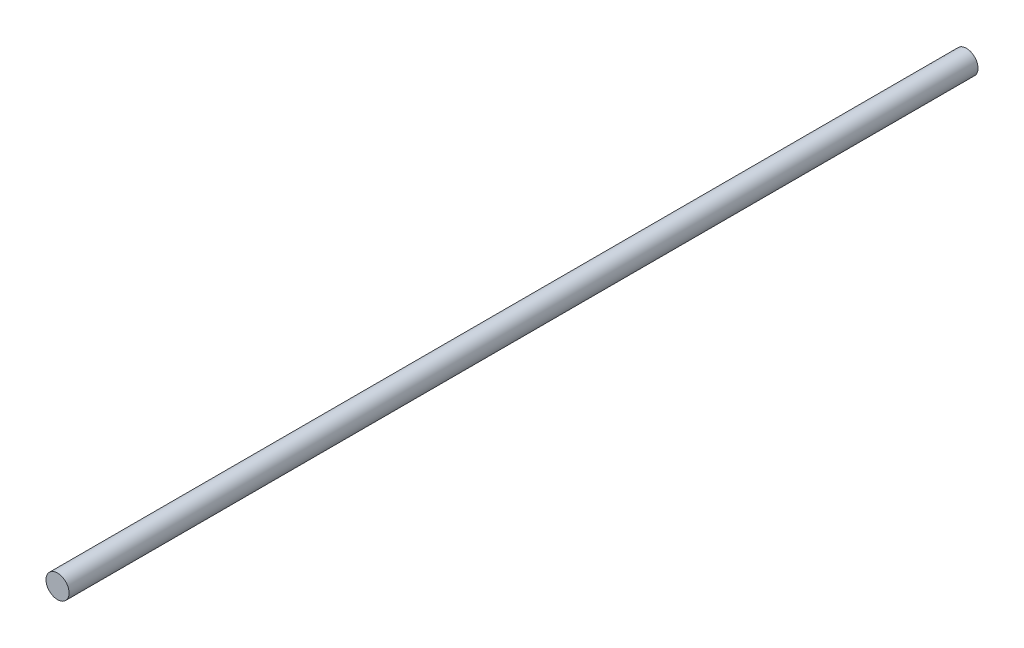
ISO-10303-21;
HEADER;
FILE_DESCRIPTION(('STEP AP214'),'2;1');
FILE_NAME('part.step','',(''),(''),'','','');
FILE_SCHEMA(('AUTOMOTIVE_DESIGN { 1 0 10303 214 1 1 1 1 }'));
ENDSEC;
DATA;
#1=APPLICATION_CONTEXT('core data for automotive mechanical design processes');
#2=APPLICATION_PROTOCOL_DEFINITION('international standard','automotive_design',2000,#1);
#3=PRODUCT_CONTEXT('',#1,'mechanical');
#4=PRODUCT('Part','Part','',(#3));
#5=PRODUCT_RELATED_PRODUCT_CATEGORY('part','',(#4));
#6=PRODUCT_DEFINITION_FORMATION('','',#4);
#7=PRODUCT_DEFINITION_CONTEXT('part definition',#1,'design');
#8=PRODUCT_DEFINITION('design','',#6,#7);
#9=PRODUCT_DEFINITION_SHAPE('','',#8);
#10=(LENGTH_UNIT() NAMED_UNIT(*) SI_UNIT(.MILLI.,.METRE.));
#11=(NAMED_UNIT(*) PLANE_ANGLE_UNIT() SI_UNIT($,.RADIAN.));
#12=(NAMED_UNIT(*) SI_UNIT($,.STERADIAN.) SOLID_ANGLE_UNIT());
#13=UNCERTAINTY_MEASURE_WITH_UNIT(LENGTH_MEASURE(1.E-05),#10,'distance_accuracy_value','');
#14=(GEOMETRIC_REPRESENTATION_CONTEXT(3) GLOBAL_UNCERTAINTY_ASSIGNED_CONTEXT((#13)) GLOBAL_UNIT_ASSIGNED_CONTEXT((#10,
#11,#12)) REPRESENTATION_CONTEXT('',''));
#15=CARTESIAN_POINT('',(0.,0.,0.));
#16=DIRECTION('',(0.,0.,1.));
#17=DIRECTION('',(1.,0.,0.));
#18=AXIS2_PLACEMENT_3D('',#15,#16,#17);
#19=CARTESIAN_POINT('',(0.,0.,315.));
#20=DIRECTION('',(0.,0.,-1.));
#21=DIRECTION('',(-1.,0.,0.));
#22=AXIS2_PLACEMENT_3D('',#19,#20,#21);
#23=CYLINDRICAL_SURFACE('',#22,4.);
#24=CARTESIAN_POINT('',(0.,0.,315.));
#25=DIRECTION('',(0.,0.,1.));
#26=DIRECTION('',(1.,0.,0.));
#27=AXIS2_PLACEMENT_3D('',#24,#25,#26);
#28=CIRCLE('',#27,4.);
#29=CARTESIAN_POINT('',(4.,0.,315.));
#30=VERTEX_POINT('',#29);
#31=EDGE_CURVE('E10',#30,#30,#28,.T.);
#32=ORIENTED_EDGE('',*,*,#31,.F.);
#33=EDGE_LOOP('',(#32));
#34=FACE_BOUND('',#33,.T.);
#35=CARTESIAN_POINT('',(0.,0.,0.));
#36=DIRECTION('',(0.,0.,1.));
#37=DIRECTION('',(1.,0.,0.));
#38=AXIS2_PLACEMENT_3D('',#35,#36,#37);
#39=CIRCLE('',#38,4.);
#40=CARTESIAN_POINT('',(4.,0.,0.));
#41=VERTEX_POINT('',#40);
#42=EDGE_CURVE('E36',#41,#41,#39,.T.);
#43=ORIENTED_EDGE('',*,*,#42,.T.);
#44=EDGE_LOOP('',(#43));
#45=FACE_BOUND('',#44,.T.);
#46=ADVANCED_FACE('F33',(#34,#45),#23,.T.);
#47=CARTESIAN_POINT('',(0.,0.,315.));
#48=DIRECTION('',(0.,0.,1.));
#49=DIRECTION('',(1.,0.,0.));
#50=AXIS2_PLACEMENT_3D('',#47,#48,#49);
#51=PLANE('',#50);
#52=ORIENTED_EDGE('',*,*,#31,.T.);
#53=EDGE_LOOP('',(#52));
#54=FACE_BOUND('',#53,.T.);
#55=ADVANCED_FACE('F48',(#54),#51,.T.);
#56=CARTESIAN_POINT('',(0.,0.,0.));
#57=DIRECTION('',(0.,0.,1.));
#58=DIRECTION('',(1.,0.,0.));
#59=AXIS2_PLACEMENT_3D('',#56,#57,#58);
#60=PLANE('',#59);
#61=ORIENTED_EDGE('',*,*,#42,.F.);
#62=EDGE_LOOP('',(#61));
#63=FACE_BOUND('',#62,.T.);
#64=ADVANCED_FACE('F46',(#63),#60,.F.);
#65=CLOSED_SHELL('',(#46,#55,#64));
#66=MANIFOLD_SOLID_BREP('B2',#65);
#67=ADVANCED_BREP_SHAPE_REPRESENTATION('',(#18,#66),#14);
#68=SHAPE_DEFINITION_REPRESENTATION(#9,#67);
ENDSEC;
END-ISO-10303-21;
